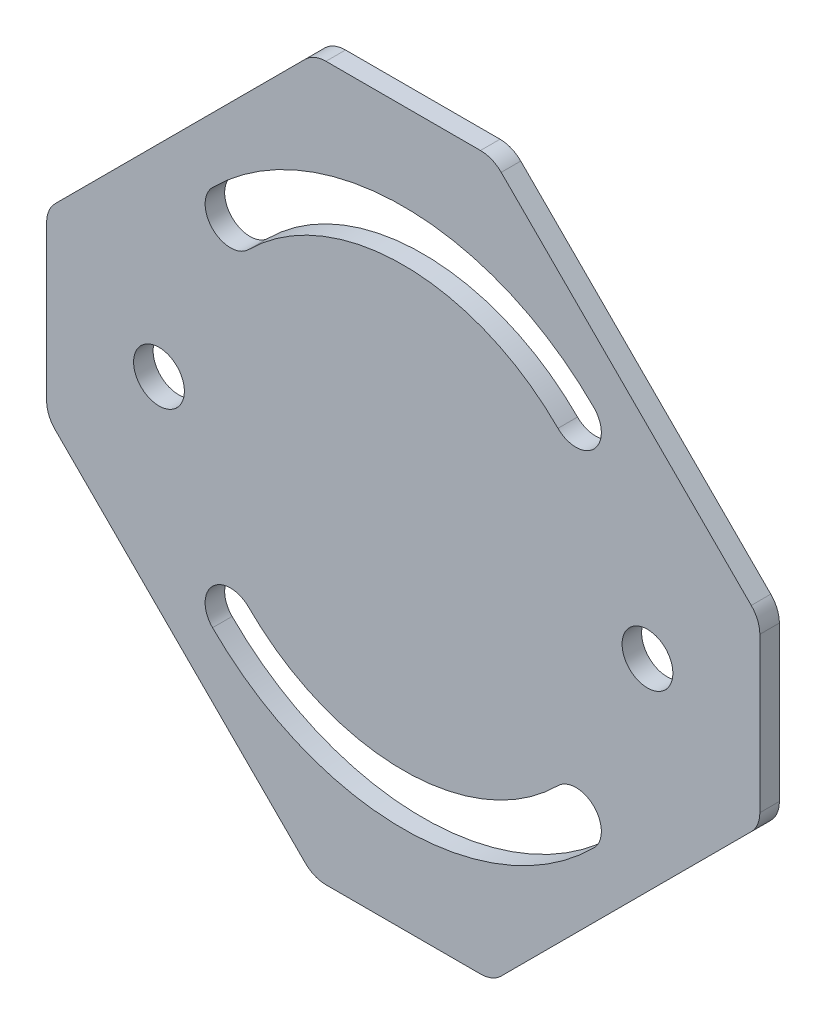
ISO-10303-21;
HEADER;
FILE_DESCRIPTION(('STEP AP214'),'2;1');
FILE_NAME('part.step','',(''),(''),'','','');
FILE_SCHEMA(('AUTOMOTIVE_DESIGN { 1 0 10303 214 1 1 1 1 }'));
ENDSEC;
DATA;
#1=APPLICATION_CONTEXT('core data for automotive mechanical design processes');
#2=APPLICATION_PROTOCOL_DEFINITION('international standard','automotive_design',2000,#1);
#3=PRODUCT_CONTEXT('',#1,'mechanical');
#4=PRODUCT('Part','Part','',(#3));
#5=PRODUCT_RELATED_PRODUCT_CATEGORY('part','',(#4));
#6=PRODUCT_DEFINITION_FORMATION('','',#4);
#7=PRODUCT_DEFINITION_CONTEXT('part definition',#1,'design');
#8=PRODUCT_DEFINITION('design','',#6,#7);
#9=PRODUCT_DEFINITION_SHAPE('','',#8);
#10=(LENGTH_UNIT() NAMED_UNIT(*) SI_UNIT(.MILLI.,.METRE.));
#11=(NAMED_UNIT(*) PLANE_ANGLE_UNIT() SI_UNIT($,.RADIAN.));
#12=(NAMED_UNIT(*) SI_UNIT($,.STERADIAN.) SOLID_ANGLE_UNIT());
#13=UNCERTAINTY_MEASURE_WITH_UNIT(LENGTH_MEASURE(1.E-05),#10,'distance_accuracy_value','');
#14=(GEOMETRIC_REPRESENTATION_CONTEXT(3) GLOBAL_UNCERTAINTY_ASSIGNED_CONTEXT((#13)) GLOBAL_UNIT_ASSIGNED_CONTEXT((#10,
#11,#12)) REPRESENTATION_CONTEXT('',''));
#15=CARTESIAN_POINT('',(0.,0.,0.));
#16=DIRECTION('',(0.,0.,1.));
#17=DIRECTION('',(1.,0.,0.));
#18=AXIS2_PLACEMENT_3D('',#15,#16,#17);
#19=CARTESIAN_POINT('',(0.,0.,2.));
#20=DIRECTION('',(0.,0.,-1.));
#21=DIRECTION('',(-1.,0.,0.));
#22=AXIS2_PLACEMENT_3D('',#19,#20,#21);
#23=PLANE('',#22);
#24=CARTESIAN_POINT('',(-17.6776695296638,-17.6776695296636,2.));
#25=DIRECTION('',(0.,0.,1.));
#26=DIRECTION('',(1.,0.,0.));
#27=AXIS2_PLACEMENT_3D('',#24,#25,#26);
#28=CIRCLE('',#27,2.6);
#29=CARTESIAN_POINT('',(-15.8391918985788,-15.8391918985786,2.));
#30=VERTEX_POINT('',#29);
#31=CARTESIAN_POINT('',(-19.5161471607488,-19.5161471607486,2.));
#32=VERTEX_POINT('',#31);
#33=EDGE_CURVE('E219',#30,#32,#28,.T.);
#34=ORIENTED_EDGE('',*,*,#33,.F.);
#35=CARTESIAN_POINT('',(0.,0.,2.));
#36=DIRECTION('',(0.,0.,-1.));
#37=DIRECTION('',(1.,0.,0.));
#38=AXIS2_PLACEMENT_3D('',#35,#36,#37);
#39=CIRCLE('',#38,22.4);
#40=CARTESIAN_POINT('',(15.8391918985788,-15.8391918985786,2.));
#41=VERTEX_POINT('',#40);
#42=EDGE_CURVE('E227',#41,#30,#39,.T.);
#43=ORIENTED_EDGE('',*,*,#42,.F.);
#44=CARTESIAN_POINT('',(17.6776695296638,-17.6776695296636,2.));
#45=DIRECTION('',(0.,0.,1.));
#46=DIRECTION('',(1.,0.,0.));
#47=AXIS2_PLACEMENT_3D('',#44,#45,#46);
#48=CIRCLE('',#47,2.6);
#49=CARTESIAN_POINT('',(19.5161471607488,-19.5161471607486,2.));
#50=VERTEX_POINT('',#49);
#51=EDGE_CURVE('E224',#50,#41,#48,.T.);
#52=ORIENTED_EDGE('',*,*,#51,.F.);
#53=CARTESIAN_POINT('',(0.,0.,2.));
#54=DIRECTION('',(0.,0.,1.));
#55=DIRECTION('',(1.,0.,0.));
#56=AXIS2_PLACEMENT_3D('',#53,#54,#55);
#57=CIRCLE('',#56,27.6);
#58=EDGE_CURVE('E221',#32,#50,#57,.T.);
#59=ORIENTED_EDGE('',*,*,#58,.F.);
#60=EDGE_LOOP('',(#34,#43,#52,#59));
#61=FACE_BOUND('',#60,.T.);
#62=DIRECTION('',(-0.707106781186548,0.707106781186548,0.));
#63=VECTOR('',#62,1.);
#64=CARTESIAN_POINT('',(9.15,36.5,2.));
#65=LINE('',#64,#63);
#66=CARTESIAN_POINT('',(35.6213203435597,10.0286796564403,2.));
#67=VERTEX_POINT('',#66);
#68=CARTESIAN_POINT('',(10.0286796564404,35.6213203435596,2.));
#69=VERTEX_POINT('',#68);
#70=EDGE_CURVE('E282',#67,#69,#65,.T.);
#71=ORIENTED_EDGE('',*,*,#70,.T.);
#72=CARTESIAN_POINT('',(7.90735931288072,33.5,2.));
#73=DIRECTION('',(0.,0.,-1.));
#74=DIRECTION('',(-1.,0.,0.));
#75=AXIS2_PLACEMENT_3D('',#72,#73,#74);
#76=CIRCLE('',#75,3.);
#77=CARTESIAN_POINT('',(7.90735931288072,36.5,2.));
#78=VERTEX_POINT('',#77);
#79=EDGE_CURVE('E345',#69,#78,#76,.F.);
#80=ORIENTED_EDGE('',*,*,#79,.T.);
#81=DIRECTION('',(-1.,0.,0.));
#82=VECTOR('',#81,1.);
#83=CARTESIAN_POINT('',(-9.15,36.5,2.));
#84=LINE('',#83,#82);
#85=CARTESIAN_POINT('',(-7.90735931288071,36.5,2.));
#86=VERTEX_POINT('',#85);
#87=EDGE_CURVE('E262',#78,#86,#84,.T.);
#88=ORIENTED_EDGE('',*,*,#87,.T.);
#89=CARTESIAN_POINT('',(-7.90735931288071,33.5,2.));
#90=DIRECTION('',(0.,0.,-1.));
#91=DIRECTION('',(-1.,0.,0.));
#92=AXIS2_PLACEMENT_3D('',#89,#90,#91);
#93=CIRCLE('',#92,3.);
#94=CARTESIAN_POINT('',(-10.0286796564404,35.6213203435596,2.));
#95=VERTEX_POINT('',#94);
#96=EDGE_CURVE('E332',#86,#95,#93,.F.);
#97=ORIENTED_EDGE('',*,*,#96,.T.);
#98=DIRECTION('',(-0.707106781186548,-0.707106781186547,0.));
#99=VECTOR('',#98,1.);
#100=CARTESIAN_POINT('',(-36.5,9.15,2.));
#101=LINE('',#100,#99);
#102=CARTESIAN_POINT('',(-35.6213203435596,10.0286796564404,2.));
#103=VERTEX_POINT('',#102);
#104=EDGE_CURVE('E265',#95,#103,#101,.T.);
#105=ORIENTED_EDGE('',*,*,#104,.T.);
#106=CARTESIAN_POINT('',(-33.5,7.90735931288071,2.));
#107=DIRECTION('',(0.,0.,-1.));
#108=DIRECTION('',(-1.,0.,0.));
#109=AXIS2_PLACEMENT_3D('',#106,#107,#108);
#110=CIRCLE('',#109,3.);
#111=CARTESIAN_POINT('',(-36.5,7.90735931288071,2.));
#112=VERTEX_POINT('',#111);
#113=EDGE_CURVE('E334',#103,#112,#110,.F.);
#114=ORIENTED_EDGE('',*,*,#113,.T.);
#115=DIRECTION('',(0.,-1.,0.));
#116=VECTOR('',#115,1.);
#117=CARTESIAN_POINT('',(-36.5,9.15,2.));
#118=LINE('',#117,#116);
#119=CARTESIAN_POINT('',(-36.5,-7.90735931288072,2.));
#120=VERTEX_POINT('',#119);
#121=EDGE_CURVE('E269',#112,#120,#118,.T.);
#122=ORIENTED_EDGE('',*,*,#121,.T.);
#123=CARTESIAN_POINT('',(-33.5,-7.90735931288072,2.));
#124=DIRECTION('',(0.,0.,-1.));
#125=DIRECTION('',(-1.,0.,0.));
#126=AXIS2_PLACEMENT_3D('',#123,#124,#125);
#127=CIRCLE('',#126,3.);
#128=CARTESIAN_POINT('',(-35.6213203435596,-10.0286796564404,2.));
#129=VERTEX_POINT('',#128);
#130=EDGE_CURVE('E336',#120,#129,#127,.F.);
#131=ORIENTED_EDGE('',*,*,#130,.T.);
#132=DIRECTION('',(0.707106781186548,-0.707106781186547,0.));
#133=VECTOR('',#132,1.);
#134=CARTESIAN_POINT('',(-36.5,-9.15,2.));
#135=LINE('',#134,#133);
#136=CARTESIAN_POINT('',(-10.0286796564404,-35.6213203435596,2.));
#137=VERTEX_POINT('',#136);
#138=EDGE_CURVE('E272',#129,#137,#135,.T.);
#139=ORIENTED_EDGE('',*,*,#138,.T.);
#140=CARTESIAN_POINT('',(-7.90735931288072,-33.5,2.));
#141=DIRECTION('',(0.,0.,-1.));
#142=DIRECTION('',(-1.,0.,0.));
#143=AXIS2_PLACEMENT_3D('',#140,#141,#142);
#144=CIRCLE('',#143,3.);
#145=CARTESIAN_POINT('',(-7.90735931288072,-36.5,2.));
#146=VERTEX_POINT('',#145);
#147=EDGE_CURVE('E338',#137,#146,#144,.F.);
#148=ORIENTED_EDGE('',*,*,#147,.T.);
#149=DIRECTION('',(1.,0.,0.));
#150=VECTOR('',#149,1.);
#151=CARTESIAN_POINT('',(-9.15,-36.5,2.));
#152=LINE('',#151,#150);
#153=CARTESIAN_POINT('',(7.90735931288072,-36.5,2.));
#154=VERTEX_POINT('',#153);
#155=EDGE_CURVE('E275',#146,#154,#152,.T.);
#156=ORIENTED_EDGE('',*,*,#155,.T.);
#157=CARTESIAN_POINT('',(7.90735931288072,-33.5,2.));
#158=DIRECTION('',(0.,0.,-1.));
#159=DIRECTION('',(-1.,0.,0.));
#160=AXIS2_PLACEMENT_3D('',#157,#158,#159);
#161=CIRCLE('',#160,3.);
#162=CARTESIAN_POINT('',(10.0286796564404,-35.6213203435596,2.));
#163=VERTEX_POINT('',#162);
#164=EDGE_CURVE('E340',#154,#163,#161,.F.);
#165=ORIENTED_EDGE('',*,*,#164,.T.);
#166=DIRECTION('',(0.707106781186547,0.707106781186547,0.));
#167=VECTOR('',#166,1.);
#168=CARTESIAN_POINT('',(9.15,-36.5,2.));
#169=LINE('',#168,#167);
#170=CARTESIAN_POINT('',(35.6213203435596,-10.0286796564404,2.));
#171=VERTEX_POINT('',#170);
#172=EDGE_CURVE('E278',#163,#171,#169,.T.);
#173=ORIENTED_EDGE('',*,*,#172,.T.);
#174=CARTESIAN_POINT('',(33.5,-7.90735931288072,2.));
#175=DIRECTION('',(0.,0.,-1.));
#176=DIRECTION('',(-1.,0.,0.));
#177=AXIS2_PLACEMENT_3D('',#174,#175,#176);
#178=CIRCLE('',#177,3.);
#179=CARTESIAN_POINT('',(36.5,-7.90735931288072,2.));
#180=VERTEX_POINT('',#179);
#181=EDGE_CURVE('E37',#171,#180,#178,.F.);
#182=ORIENTED_EDGE('',*,*,#181,.T.);
#183=DIRECTION('',(0.,1.,0.));
#184=VECTOR('',#183,1.);
#185=CARTESIAN_POINT('',(36.5,9.15,2.));
#186=LINE('',#185,#184);
#187=CARTESIAN_POINT('',(36.5,7.90735931288071,2.));
#188=VERTEX_POINT('',#187);
#189=EDGE_CURVE('E280',#180,#188,#186,.T.);
#190=ORIENTED_EDGE('',*,*,#189,.T.);
#191=CARTESIAN_POINT('',(33.5,7.90735931288071,2.));
#192=DIRECTION('',(0.,0.,-1.));
#193=DIRECTION('',(-1.,0.,0.));
#194=AXIS2_PLACEMENT_3D('',#191,#192,#193);
#195=CIRCLE('',#194,3.);
#196=EDGE_CURVE('E343',#188,#67,#195,.F.);
#197=ORIENTED_EDGE('',*,*,#196,.T.);
#198=EDGE_LOOP('',(#71,#80,#88,#97,#105,#114,#122,#131,#139,#148,#156,#165,#173,#182,#190,#197));
#199=FACE_BOUND('',#198,.T.);
#200=CARTESIAN_POINT('',(-25.,0.,2.));
#201=DIRECTION('',(0.,0.,1.));
#202=DIRECTION('',(1.,0.,0.));
#203=AXIS2_PLACEMENT_3D('',#200,#201,#202);
#204=CIRCLE('',#203,2.6);
#205=CARTESIAN_POINT('',(-22.4,0.,2.));
#206=VERTEX_POINT('',#205);
#207=EDGE_CURVE('E256',#206,#206,#204,.T.);
#208=ORIENTED_EDGE('',*,*,#207,.F.);
#209=EDGE_LOOP('',(#208));
#210=FACE_BOUND('',#209,.T.);
#211=CARTESIAN_POINT('',(25.,0.,2.));
#212=DIRECTION('',(0.,0.,1.));
#213=DIRECTION('',(1.,0.,0.));
#214=AXIS2_PLACEMENT_3D('',#211,#212,#213);
#215=CIRCLE('',#214,2.6);
#216=CARTESIAN_POINT('',(27.6,0.,2.));
#217=VERTEX_POINT('',#216);
#218=EDGE_CURVE('E250',#217,#217,#215,.T.);
#219=ORIENTED_EDGE('',*,*,#218,.F.);
#220=EDGE_LOOP('',(#219));
#221=FACE_BOUND('',#220,.T.);
#222=CARTESIAN_POINT('',(-17.6776695296638,17.6776695296636,2.));
#223=DIRECTION('',(0.,0.,1.));
#224=DIRECTION('',(-1.,0.,0.));
#225=AXIS2_PLACEMENT_3D('',#222,#223,#224);
#226=CIRCLE('',#225,2.6);
#227=CARTESIAN_POINT('',(-19.5161471607488,19.5161471607486,2.));
#228=VERTEX_POINT('',#227);
#229=CARTESIAN_POINT('',(-15.8391918985787,15.8391918985786,2.));
#230=VERTEX_POINT('',#229);
#231=EDGE_CURVE('E178',#228,#230,#226,.T.);
#232=ORIENTED_EDGE('',*,*,#231,.F.);
#233=CARTESIAN_POINT('',(0.,0.,2.));
#234=DIRECTION('',(0.,0.,1.));
#235=DIRECTION('',(-1.,0.,0.));
#236=AXIS2_PLACEMENT_3D('',#233,#234,#235);
#237=CIRCLE('',#236,27.6);
#238=CARTESIAN_POINT('',(19.5161471607488,19.5161471607486,2.));
#239=VERTEX_POINT('',#238);
#240=EDGE_CURVE('E203',#239,#228,#237,.T.);
#241=ORIENTED_EDGE('',*,*,#240,.F.);
#242=CARTESIAN_POINT('',(17.6776695296638,17.6776695296636,2.));
#243=DIRECTION('',(0.,0.,1.));
#244=DIRECTION('',(-1.,0.,0.));
#245=AXIS2_PLACEMENT_3D('',#242,#243,#244);
#246=CIRCLE('',#245,2.6);
#247=CARTESIAN_POINT('',(15.8391918985788,15.8391918985786,2.));
#248=VERTEX_POINT('',#247);
#249=EDGE_CURVE('E201',#248,#239,#246,.T.);
#250=ORIENTED_EDGE('',*,*,#249,.F.);
#251=CARTESIAN_POINT('',(0.,0.,2.));
#252=DIRECTION('',(0.,0.,-1.));
#253=DIRECTION('',(-1.,0.,0.));
#254=AXIS2_PLACEMENT_3D('',#251,#252,#253);
#255=CIRCLE('',#254,22.4);
#256=EDGE_CURVE('E188',#230,#248,#255,.T.);
#257=ORIENTED_EDGE('',*,*,#256,.F.);
#258=EDGE_LOOP('',(#232,#241,#250,#257));
#259=FACE_BOUND('',#258,.T.);
#260=ADVANCED_FACE('F15',(#61,#199,#210,#221,#259),#23,.F.);
#261=CARTESIAN_POINT('',(0.,0.,0.));
#262=DIRECTION('',(0.,0.,-1.));
#263=DIRECTION('',(-1.,0.,0.));
#264=AXIS2_PLACEMENT_3D('',#261,#262,#263);
#265=PLANE('',#264);
#266=CARTESIAN_POINT('',(-25.,0.,0.));
#267=DIRECTION('',(0.,0.,1.));
#268=DIRECTION('',(1.,0.,0.));
#269=AXIS2_PLACEMENT_3D('',#266,#267,#268);
#270=CIRCLE('',#269,2.6);
#271=CARTESIAN_POINT('',(-22.4,0.,0.));
#272=VERTEX_POINT('',#271);
#273=EDGE_CURVE('E253',#272,#272,#270,.T.);
#274=ORIENTED_EDGE('',*,*,#273,.T.);
#275=EDGE_LOOP('',(#274));
#276=FACE_BOUND('',#275,.T.);
#277=DIRECTION('',(-1.,0.,0.));
#278=VECTOR('',#277,1.);
#279=CARTESIAN_POINT('',(-9.15,36.5,0.));
#280=LINE('',#279,#278);
#281=CARTESIAN_POINT('',(7.90735931288072,36.5,0.));
#282=VERTEX_POINT('',#281);
#283=CARTESIAN_POINT('',(-7.90735931288071,36.5,0.));
#284=VERTEX_POINT('',#283);
#285=EDGE_CURVE('E259',#282,#284,#280,.T.);
#286=ORIENTED_EDGE('',*,*,#285,.F.);
#287=CARTESIAN_POINT('',(7.90735931288072,33.5,0.));
#288=DIRECTION('',(0.,0.,-1.));
#289=DIRECTION('',(-1.,0.,0.));
#290=AXIS2_PLACEMENT_3D('',#287,#288,#289);
#291=CIRCLE('',#290,3.);
#292=CARTESIAN_POINT('',(10.0286796564404,35.6213203435596,0.));
#293=VERTEX_POINT('',#292);
#294=EDGE_CURVE('E325',#282,#293,#291,.T.);
#295=ORIENTED_EDGE('',*,*,#294,.T.);
#296=DIRECTION('',(-0.707106781186548,0.707106781186548,0.));
#297=VECTOR('',#296,1.);
#298=CARTESIAN_POINT('',(9.15,36.5,0.));
#299=LINE('',#298,#297);
#300=CARTESIAN_POINT('',(35.6213203435597,10.0286796564403,0.));
#301=VERTEX_POINT('',#300);
#302=EDGE_CURVE('E266',#301,#293,#299,.T.);
#303=ORIENTED_EDGE('',*,*,#302,.F.);
#304=CARTESIAN_POINT('',(33.5,7.90735931288071,0.));
#305=DIRECTION('',(0.,0.,-1.));
#306=DIRECTION('',(-1.,0.,0.));
#307=AXIS2_PLACEMENT_3D('',#304,#305,#306);
#308=CIRCLE('',#307,3.);
#309=CARTESIAN_POINT('',(36.5,7.90735931288071,0.));
#310=VERTEX_POINT('',#309);
#311=EDGE_CURVE('E323',#301,#310,#308,.T.);
#312=ORIENTED_EDGE('',*,*,#311,.T.);
#313=DIRECTION('',(0.,1.,0.));
#314=VECTOR('',#313,1.);
#315=CARTESIAN_POINT('',(36.5,9.15,0.));
#316=LINE('',#315,#314);
#317=CARTESIAN_POINT('',(36.5,-7.90735931288072,0.));
#318=VERTEX_POINT('',#317);
#319=EDGE_CURVE('E303',#318,#310,#316,.T.);
#320=ORIENTED_EDGE('',*,*,#319,.F.);
#321=CARTESIAN_POINT('',(33.5,-7.90735931288072,0.));
#322=DIRECTION('',(0.,0.,-1.));
#323=DIRECTION('',(-1.,0.,0.));
#324=AXIS2_PLACEMENT_3D('',#321,#322,#323);
#325=CIRCLE('',#324,3.);
#326=CARTESIAN_POINT('',(35.6213203435596,-10.0286796564404,0.));
#327=VERTEX_POINT('',#326);
#328=EDGE_CURVE('E321',#318,#327,#325,.T.);
#329=ORIENTED_EDGE('',*,*,#328,.T.);
#330=DIRECTION('',(0.707106781186547,0.707106781186547,0.));
#331=VECTOR('',#330,1.);
#332=CARTESIAN_POINT('',(9.15,-36.5,0.));
#333=LINE('',#332,#331);
#334=CARTESIAN_POINT('',(10.0286796564404,-35.6213203435596,0.));
#335=VERTEX_POINT('',#334);
#336=EDGE_CURVE('E300',#335,#327,#333,.T.);
#337=ORIENTED_EDGE('',*,*,#336,.F.);
#338=CARTESIAN_POINT('',(7.90735931288072,-33.5,0.));
#339=DIRECTION('',(0.,0.,-1.));
#340=DIRECTION('',(-1.,0.,0.));
#341=AXIS2_PLACEMENT_3D('',#338,#339,#340);
#342=CIRCLE('',#341,3.);
#343=CARTESIAN_POINT('',(7.90735931288072,-36.5,0.));
#344=VERTEX_POINT('',#343);
#345=EDGE_CURVE('E319',#335,#344,#342,.T.);
#346=ORIENTED_EDGE('',*,*,#345,.T.);
#347=DIRECTION('',(1.,0.,0.));
#348=VECTOR('',#347,1.);
#349=CARTESIAN_POINT('',(-9.15,-36.5,0.));
#350=LINE('',#349,#348);
#351=CARTESIAN_POINT('',(-7.90735931288072,-36.5,0.));
#352=VERTEX_POINT('',#351);
#353=EDGE_CURVE('E297',#352,#344,#350,.T.);
#354=ORIENTED_EDGE('',*,*,#353,.F.);
#355=CARTESIAN_POINT('',(-7.90735931288072,-33.5,0.));
#356=DIRECTION('',(0.,0.,-1.));
#357=DIRECTION('',(-1.,0.,0.));
#358=AXIS2_PLACEMENT_3D('',#355,#356,#357);
#359=CIRCLE('',#358,3.);
#360=CARTESIAN_POINT('',(-10.0286796564404,-35.6213203435596,0.));
#361=VERTEX_POINT('',#360);
#362=EDGE_CURVE('E317',#352,#361,#359,.T.);
#363=ORIENTED_EDGE('',*,*,#362,.T.);
#364=DIRECTION('',(0.707106781186548,-0.707106781186547,0.));
#365=VECTOR('',#364,1.);
#366=CARTESIAN_POINT('',(-36.5,-9.15,0.));
#367=LINE('',#366,#365);
#368=CARTESIAN_POINT('',(-35.6213203435596,-10.0286796564404,0.));
#369=VERTEX_POINT('',#368);
#370=EDGE_CURVE('E294',#369,#361,#367,.T.);
#371=ORIENTED_EDGE('',*,*,#370,.F.);
#372=CARTESIAN_POINT('',(-33.5,-7.90735931288072,0.));
#373=DIRECTION('',(0.,0.,-1.));
#374=DIRECTION('',(-1.,0.,0.));
#375=AXIS2_PLACEMENT_3D('',#372,#373,#374);
#376=CIRCLE('',#375,3.);
#377=CARTESIAN_POINT('',(-36.5,-7.90735931288072,0.));
#378=VERTEX_POINT('',#377);
#379=EDGE_CURVE('E315',#369,#378,#376,.T.);
#380=ORIENTED_EDGE('',*,*,#379,.T.);
#381=DIRECTION('',(0.,-1.,0.));
#382=VECTOR('',#381,1.);
#383=CARTESIAN_POINT('',(-36.5,9.15,0.));
#384=LINE('',#383,#382);
#385=CARTESIAN_POINT('',(-36.5,7.90735931288071,0.));
#386=VERTEX_POINT('',#385);
#387=EDGE_CURVE('E291',#386,#378,#384,.T.);
#388=ORIENTED_EDGE('',*,*,#387,.F.);
#389=CARTESIAN_POINT('',(-33.5,7.90735931288071,0.));
#390=DIRECTION('',(0.,0.,-1.));
#391=DIRECTION('',(-1.,0.,0.));
#392=AXIS2_PLACEMENT_3D('',#389,#390,#391);
#393=CIRCLE('',#392,3.);
#394=CARTESIAN_POINT('',(-35.6213203435596,10.0286796564404,0.));
#395=VERTEX_POINT('',#394);
#396=EDGE_CURVE('E313',#386,#395,#393,.T.);
#397=ORIENTED_EDGE('',*,*,#396,.T.);
#398=DIRECTION('',(-0.707106781186548,-0.707106781186547,0.));
#399=VECTOR('',#398,1.);
#400=CARTESIAN_POINT('',(-36.5,9.15,0.));
#401=LINE('',#400,#399);
#402=CARTESIAN_POINT('',(-10.0286796564404,35.6213203435596,0.));
#403=VERTEX_POINT('',#402);
#404=EDGE_CURVE('E288',#403,#395,#401,.T.);
#405=ORIENTED_EDGE('',*,*,#404,.F.);
#406=CARTESIAN_POINT('',(-7.90735931288071,33.5,0.));
#407=DIRECTION('',(0.,0.,-1.));
#408=DIRECTION('',(-1.,0.,0.));
#409=AXIS2_PLACEMENT_3D('',#406,#407,#408);
#410=CIRCLE('',#409,3.);
#411=EDGE_CURVE('E311',#403,#284,#410,.T.);
#412=ORIENTED_EDGE('',*,*,#411,.T.);
#413=EDGE_LOOP('',(#286,#295,#303,#312,#320,#329,#337,#346,#354,#363,#371,#380,#388,#397,#405,#412));
#414=FACE_BOUND('',#413,.T.);
#415=CARTESIAN_POINT('',(25.,0.,0.));
#416=DIRECTION('',(0.,0.,1.));
#417=DIRECTION('',(1.,0.,0.));
#418=AXIS2_PLACEMENT_3D('',#415,#416,#417);
#419=CIRCLE('',#418,2.6);
#420=CARTESIAN_POINT('',(27.6,0.,0.));
#421=VERTEX_POINT('',#420);
#422=EDGE_CURVE('E249',#421,#421,#419,.T.);
#423=ORIENTED_EDGE('',*,*,#422,.T.);
#424=EDGE_LOOP('',(#423));
#425=FACE_BOUND('',#424,.T.);
#426=CARTESIAN_POINT('',(0.,0.,0.));
#427=DIRECTION('',(0.,0.,-1.));
#428=DIRECTION('',(1.,0.,0.));
#429=AXIS2_PLACEMENT_3D('',#426,#427,#428);
#430=CIRCLE('',#429,22.4);
#431=CARTESIAN_POINT('',(15.8391918985788,-15.8391918985786,0.));
#432=VERTEX_POINT('',#431);
#433=CARTESIAN_POINT('',(-15.8391918985788,-15.8391918985786,0.));
#434=VERTEX_POINT('',#433);
#435=EDGE_CURVE('E222',#432,#434,#430,.T.);
#436=ORIENTED_EDGE('',*,*,#435,.T.);
#437=CARTESIAN_POINT('',(-17.6776695296638,-17.6776695296636,0.));
#438=DIRECTION('',(0.,0.,1.));
#439=DIRECTION('',(1.,0.,0.));
#440=AXIS2_PLACEMENT_3D('',#437,#438,#439);
#441=CIRCLE('',#440,2.6);
#442=CARTESIAN_POINT('',(-19.5161471607488,-19.5161471607486,0.));
#443=VERTEX_POINT('',#442);
#444=EDGE_CURVE('E196',#434,#443,#441,.T.);
#445=ORIENTED_EDGE('',*,*,#444,.T.);
#446=CARTESIAN_POINT('',(0.,0.,0.));
#447=DIRECTION('',(0.,0.,1.));
#448=DIRECTION('',(1.,0.,0.));
#449=AXIS2_PLACEMENT_3D('',#446,#447,#448);
#450=CIRCLE('',#449,27.6);
#451=CARTESIAN_POINT('',(19.5161471607488,-19.5161471607486,0.));
#452=VERTEX_POINT('',#451);
#453=EDGE_CURVE('E232',#443,#452,#450,.T.);
#454=ORIENTED_EDGE('',*,*,#453,.T.);
#455=CARTESIAN_POINT('',(17.6776695296638,-17.6776695296636,0.));
#456=DIRECTION('',(0.,0.,1.));
#457=DIRECTION('',(1.,0.,0.));
#458=AXIS2_PLACEMENT_3D('',#455,#456,#457);
#459=CIRCLE('',#458,2.6);
#460=EDGE_CURVE('E235',#452,#432,#459,.T.);
#461=ORIENTED_EDGE('',*,*,#460,.T.);
#462=EDGE_LOOP('',(#436,#445,#454,#461));
#463=FACE_BOUND('',#462,.T.);
#464=CARTESIAN_POINT('',(0.,0.,0.));
#465=DIRECTION('',(0.,0.,1.));
#466=DIRECTION('',(-1.,0.,0.));
#467=AXIS2_PLACEMENT_3D('',#464,#465,#466);
#468=CIRCLE('',#467,27.6);
#469=CARTESIAN_POINT('',(19.5161471607488,19.5161471607486,0.));
#470=VERTEX_POINT('',#469);
#471=CARTESIAN_POINT('',(-19.5161471607488,19.5161471607486,0.));
#472=VERTEX_POINT('',#471);
#473=EDGE_CURVE('E189',#470,#472,#468,.T.);
#474=ORIENTED_EDGE('',*,*,#473,.T.);
#475=CARTESIAN_POINT('',(-17.6776695296638,17.6776695296636,0.));
#476=DIRECTION('',(0.,0.,1.));
#477=DIRECTION('',(-1.,0.,0.));
#478=AXIS2_PLACEMENT_3D('',#475,#476,#477);
#479=CIRCLE('',#478,2.6);
#480=CARTESIAN_POINT('',(-15.8391918985787,15.8391918985786,0.));
#481=VERTEX_POINT('',#480);
#482=EDGE_CURVE('E207',#472,#481,#479,.T.);
#483=ORIENTED_EDGE('',*,*,#482,.T.);
#484=CARTESIAN_POINT('',(0.,0.,0.));
#485=DIRECTION('',(0.,0.,-1.));
#486=DIRECTION('',(-1.,0.,0.));
#487=AXIS2_PLACEMENT_3D('',#484,#485,#486);
#488=CIRCLE('',#487,22.4);
#489=CARTESIAN_POINT('',(15.8391918985788,15.8391918985786,0.));
#490=VERTEX_POINT('',#489);
#491=EDGE_CURVE('E195',#481,#490,#488,.T.);
#492=ORIENTED_EDGE('',*,*,#491,.T.);
#493=CARTESIAN_POINT('',(17.6776695296638,17.6776695296636,0.));
#494=DIRECTION('',(0.,0.,1.));
#495=DIRECTION('',(-1.,0.,0.));
#496=AXIS2_PLACEMENT_3D('',#493,#494,#495);
#497=CIRCLE('',#496,2.6);
#498=EDGE_CURVE('E210',#490,#470,#497,.T.);
#499=ORIENTED_EDGE('',*,*,#498,.T.);
#500=EDGE_LOOP('',(#474,#483,#492,#499));
#501=FACE_BOUND('',#500,.T.);
#502=ADVANCED_FACE('F381',(#276,#414,#425,#463,#501),#265,.T.);
#503=CARTESIAN_POINT('',(-9.15,36.5,2.));
#504=DIRECTION('',(0.,-1.,0.));
#505=DIRECTION('',(0.,0.,-1.));
#506=AXIS2_PLACEMENT_3D('',#503,#504,#505);
#507=PLANE('',#506);
#508=ORIENTED_EDGE('',*,*,#87,.F.);
#509=DIRECTION('',(0.,0.,-1.));
#510=VECTOR('',#509,1.);
#511=CARTESIAN_POINT('',(7.90735931288072,36.5,2.));
#512=LINE('',#511,#510);
#513=EDGE_CURVE('E308',#78,#282,#512,.T.);
#514=ORIENTED_EDGE('',*,*,#513,.T.);
#515=ORIENTED_EDGE('',*,*,#285,.T.);
#516=DIRECTION('',(0.,0.,-1.));
#517=VECTOR('',#516,1.);
#518=CARTESIAN_POINT('',(-7.90735931288071,36.5,2.));
#519=LINE('',#518,#517);
#520=EDGE_CURVE('E285',#284,#86,#519,.F.);
#521=ORIENTED_EDGE('',*,*,#520,.T.);
#522=EDGE_LOOP('',(#508,#514,#515,#521));
#523=FACE_BOUND('',#522,.T.);
#524=ADVANCED_FACE('F440',(#523),#507,.F.);
#525=CARTESIAN_POINT('',(-36.5,9.15,2.));
#526=DIRECTION('',(0.707106781186547,-0.707106781186548,0.));
#527=DIRECTION('',(0.707106781186548,0.707106781186547,0.));
#528=AXIS2_PLACEMENT_3D('',#525,#526,#527);
#529=PLANE('',#528);
#530=ORIENTED_EDGE('',*,*,#404,.T.);
#531=DIRECTION('',(0.,0.,-1.));
#532=VECTOR('',#531,1.);
#533=CARTESIAN_POINT('',(-35.6213203435596,10.0286796564404,2.));
#534=LINE('',#533,#532);
#535=EDGE_CURVE('E9',#395,#103,#534,.F.);
#536=ORIENTED_EDGE('',*,*,#535,.T.);
#537=ORIENTED_EDGE('',*,*,#104,.F.);
#538=DIRECTION('',(0.,0.,-1.));
#539=VECTOR('',#538,1.);
#540=CARTESIAN_POINT('',(-10.0286796564404,35.6213203435596,2.));
#541=LINE('',#540,#539);
#542=EDGE_CURVE('E23',#95,#403,#541,.T.);
#543=ORIENTED_EDGE('',*,*,#542,.T.);
#544=EDGE_LOOP('',(#530,#536,#537,#543));
#545=FACE_BOUND('',#544,.T.);
#546=ADVANCED_FACE('F375',(#545),#529,.F.);
#547=CARTESIAN_POINT('',(-36.5,9.15,2.));
#548=DIRECTION('',(1.,0.,0.));
#549=DIRECTION('',(0.,1.,0.));
#550=AXIS2_PLACEMENT_3D('',#547,#548,#549);
#551=PLANE('',#550);
#552=ORIENTED_EDGE('',*,*,#387,.T.);
#553=DIRECTION('',(0.,0.,-1.));
#554=VECTOR('',#553,1.);
#555=CARTESIAN_POINT('',(-36.5,-7.90735931288072,2.));
#556=LINE('',#555,#554);
#557=EDGE_CURVE('E369',#378,#120,#556,.F.);
#558=ORIENTED_EDGE('',*,*,#557,.T.);
#559=ORIENTED_EDGE('',*,*,#121,.F.);
#560=DIRECTION('',(0.,0.,-1.));
#561=VECTOR('',#560,1.);
#562=CARTESIAN_POINT('',(-36.5,7.90735931288071,2.));
#563=LINE('',#562,#561);
#564=EDGE_CURVE('E366',#112,#386,#563,.T.);
#565=ORIENTED_EDGE('',*,*,#564,.T.);
#566=EDGE_LOOP('',(#552,#558,#559,#565));
#567=FACE_BOUND('',#566,.T.);
#568=ADVANCED_FACE('F390',(#567),#551,.F.);
#569=CARTESIAN_POINT('',(-36.5,-9.15,2.));
#570=DIRECTION('',(0.707106781186547,0.707106781186548,0.));
#571=DIRECTION('',(-0.707106781186548,0.707106781186547,0.));
#572=AXIS2_PLACEMENT_3D('',#569,#570,#571);
#573=PLANE('',#572);
#574=ORIENTED_EDGE('',*,*,#370,.T.);
#575=DIRECTION('',(0.,0.,-1.));
#576=VECTOR('',#575,1.);
#577=CARTESIAN_POINT('',(-10.0286796564404,-35.6213203435596,2.));
#578=LINE('',#577,#576);
#579=EDGE_CURVE('E364',#361,#137,#578,.F.);
#580=ORIENTED_EDGE('',*,*,#579,.T.);
#581=ORIENTED_EDGE('',*,*,#138,.F.);
#582=DIRECTION('',(0.,0.,-1.));
#583=VECTOR('',#582,1.);
#584=CARTESIAN_POINT('',(-35.6213203435596,-10.0286796564404,2.));
#585=LINE('',#584,#583);
#586=EDGE_CURVE('E361',#129,#369,#585,.T.);
#587=ORIENTED_EDGE('',*,*,#586,.T.);
#588=EDGE_LOOP('',(#574,#580,#581,#587));
#589=FACE_BOUND('',#588,.T.);
#590=ADVANCED_FACE('F400',(#589),#573,.F.);
#591=CARTESIAN_POINT('',(-9.15,-36.5,2.));
#592=DIRECTION('',(0.,1.,0.));
#593=DIRECTION('',(0.,0.,1.));
#594=AXIS2_PLACEMENT_3D('',#591,#592,#593);
#595=PLANE('',#594);
#596=ORIENTED_EDGE('',*,*,#353,.T.);
#597=DIRECTION('',(0.,0.,-1.));
#598=VECTOR('',#597,1.);
#599=CARTESIAN_POINT('',(7.90735931288072,-36.5,2.));
#600=LINE('',#599,#598);
#601=EDGE_CURVE('E359',#344,#154,#600,.F.);
#602=ORIENTED_EDGE('',*,*,#601,.T.);
#603=ORIENTED_EDGE('',*,*,#155,.F.);
#604=DIRECTION('',(0.,0.,-1.));
#605=VECTOR('',#604,1.);
#606=CARTESIAN_POINT('',(-7.90735931288072,-36.5,2.));
#607=LINE('',#606,#605);
#608=EDGE_CURVE('E356',#146,#352,#607,.T.);
#609=ORIENTED_EDGE('',*,*,#608,.T.);
#610=EDGE_LOOP('',(#596,#602,#603,#609));
#611=FACE_BOUND('',#610,.T.);
#612=ADVANCED_FACE('F409',(#611),#595,.F.);
#613=CARTESIAN_POINT('',(9.15,-36.5,2.));
#614=DIRECTION('',(-0.707106781186547,0.707106781186547,0.));
#615=DIRECTION('',(-0.707106781186548,-0.707106781186548,0.));
#616=AXIS2_PLACEMENT_3D('',#613,#614,#615);
#617=PLANE('',#616);
#618=ORIENTED_EDGE('',*,*,#336,.T.);
#619=DIRECTION('',(0.,0.,-1.));
#620=VECTOR('',#619,1.);
#621=CARTESIAN_POINT('',(35.6213203435596,-10.0286796564404,2.));
#622=LINE('',#621,#620);
#623=EDGE_CURVE('E354',#327,#171,#622,.F.);
#624=ORIENTED_EDGE('',*,*,#623,.T.);
#625=ORIENTED_EDGE('',*,*,#172,.F.);
#626=DIRECTION('',(0.,0.,-1.));
#627=VECTOR('',#626,1.);
#628=CARTESIAN_POINT('',(10.0286796564404,-35.6213203435596,2.));
#629=LINE('',#628,#627);
#630=EDGE_CURVE('E351',#163,#335,#629,.T.);
#631=ORIENTED_EDGE('',*,*,#630,.T.);
#632=EDGE_LOOP('',(#618,#624,#625,#631));
#633=FACE_BOUND('',#632,.T.);
#634=ADVANCED_FACE('F418',(#633),#617,.F.);
#635=CARTESIAN_POINT('',(36.5,9.15,2.));
#636=DIRECTION('',(-1.,0.,0.));
#637=DIRECTION('',(0.,-1.,0.));
#638=AXIS2_PLACEMENT_3D('',#635,#636,#637);
#639=PLANE('',#638);
#640=ORIENTED_EDGE('',*,*,#319,.T.);
#641=DIRECTION('',(0.,0.,-1.));
#642=VECTOR('',#641,1.);
#643=CARTESIAN_POINT('',(36.5,7.90735931288071,2.));
#644=LINE('',#643,#642);
#645=EDGE_CURVE('E30',#310,#188,#644,.F.);
#646=ORIENTED_EDGE('',*,*,#645,.T.);
#647=ORIENTED_EDGE('',*,*,#189,.F.);
#648=DIRECTION('',(0.,0.,-1.));
#649=VECTOR('',#648,1.);
#650=CARTESIAN_POINT('',(36.5,-7.90735931288072,2.));
#651=LINE('',#650,#649);
#652=EDGE_CURVE('E347',#180,#318,#651,.T.);
#653=ORIENTED_EDGE('',*,*,#652,.T.);
#654=EDGE_LOOP('',(#640,#646,#647,#653));
#655=FACE_BOUND('',#654,.T.);
#656=ADVANCED_FACE('F424',(#655),#639,.F.);
#657=CARTESIAN_POINT('',(9.15,36.5,2.));
#658=DIRECTION('',(-0.707106781186547,-0.707106781186547,0.));
#659=DIRECTION('',(0.707106781186548,-0.707106781186548,0.));
#660=AXIS2_PLACEMENT_3D('',#657,#658,#659);
#661=PLANE('',#660);
#662=ORIENTED_EDGE('',*,*,#302,.T.);
#663=DIRECTION('',(0.,0.,-1.));
#664=VECTOR('',#663,1.);
#665=CARTESIAN_POINT('',(10.0286796564404,35.6213203435596,2.));
#666=LINE('',#665,#664);
#667=EDGE_CURVE('E330',#293,#69,#666,.F.);
#668=ORIENTED_EDGE('',*,*,#667,.T.);
#669=ORIENTED_EDGE('',*,*,#70,.F.);
#670=DIRECTION('',(0.,0.,-1.));
#671=VECTOR('',#670,1.);
#672=CARTESIAN_POINT('',(35.6213203435596,10.0286796564404,2.));
#673=LINE('',#672,#671);
#674=EDGE_CURVE('E327',#67,#301,#673,.T.);
#675=ORIENTED_EDGE('',*,*,#674,.T.);
#676=EDGE_LOOP('',(#662,#668,#669,#675));
#677=FACE_BOUND('',#676,.T.);
#678=ADVANCED_FACE('F432',(#677),#661,.F.);
#679=CARTESIAN_POINT('',(-25.,0.,2.));
#680=DIRECTION('',(0.,0.,-1.));
#681=DIRECTION('',(-1.,0.,0.));
#682=AXIS2_PLACEMENT_3D('',#679,#680,#681);
#683=CYLINDRICAL_SURFACE('',#682,2.6);
#684=ORIENTED_EDGE('',*,*,#207,.T.);
#685=EDGE_LOOP('',(#684));
#686=FACE_BOUND('',#685,.T.);
#687=ORIENTED_EDGE('',*,*,#273,.F.);
#688=EDGE_LOOP('',(#687));
#689=FACE_BOUND('',#688,.T.);
#690=ADVANCED_FACE('F457',(#686,#689),#683,.F.);
#691=CARTESIAN_POINT('',(25.,0.,2.));
#692=DIRECTION('',(0.,0.,-1.));
#693=DIRECTION('',(-1.,0.,0.));
#694=AXIS2_PLACEMENT_3D('',#691,#692,#693);
#695=CYLINDRICAL_SURFACE('',#694,2.6);
#696=ORIENTED_EDGE('',*,*,#218,.T.);
#697=EDGE_LOOP('',(#696));
#698=FACE_BOUND('',#697,.T.);
#699=ORIENTED_EDGE('',*,*,#422,.F.);
#700=EDGE_LOOP('',(#699));
#701=FACE_BOUND('',#700,.T.);
#702=ADVANCED_FACE('F651',(#698,#701),#695,.F.);
#703=CARTESIAN_POINT('',(-17.6776695296638,-17.6776695296636,2.));
#704=DIRECTION('',(0.,0.,-1.));
#705=DIRECTION('',(-1.,0.,0.));
#706=AXIS2_PLACEMENT_3D('',#703,#704,#705);
#707=CYLINDRICAL_SURFACE('',#706,2.6);
#708=ORIENTED_EDGE('',*,*,#444,.F.);
#709=DIRECTION('',(0.,0.,-1.));
#710=VECTOR('',#709,1.);
#711=CARTESIAN_POINT('',(-15.8391918985788,-15.8391918985786,2.));
#712=LINE('',#711,#710);
#713=EDGE_CURVE('E229',#30,#434,#712,.T.);
#714=ORIENTED_EDGE('',*,*,#713,.F.);
#715=ORIENTED_EDGE('',*,*,#33,.T.);
#716=DIRECTION('',(0.,0.,-1.));
#717=VECTOR('',#716,1.);
#718=CARTESIAN_POINT('',(-19.5161471607488,-19.5161471607486,2.));
#719=LINE('',#718,#717);
#720=EDGE_CURVE('E246',#32,#443,#719,.T.);
#721=ORIENTED_EDGE('',*,*,#720,.T.);
#722=EDGE_LOOP('',(#708,#714,#715,#721));
#723=FACE_BOUND('',#722,.T.);
#724=ADVANCED_FACE('F642',(#723),#707,.F.);
#725=CARTESIAN_POINT('',(0.,0.,2.));
#726=DIRECTION('',(0.,0.,-1.));
#727=DIRECTION('',(-1.,0.,0.));
#728=AXIS2_PLACEMENT_3D('',#725,#726,#727);
#729=CYLINDRICAL_SURFACE('',#728,27.6);
#730=ORIENTED_EDGE('',*,*,#453,.F.);
#731=ORIENTED_EDGE('',*,*,#720,.F.);
#732=ORIENTED_EDGE('',*,*,#58,.T.);
#733=DIRECTION('',(0.,0.,-1.));
#734=VECTOR('',#733,1.);
#735=CARTESIAN_POINT('',(19.5161471607488,-19.5161471607486,2.));
#736=LINE('',#735,#734);
#737=EDGE_CURVE('E244',#50,#452,#736,.T.);
#738=ORIENTED_EDGE('',*,*,#737,.T.);
#739=EDGE_LOOP('',(#730,#731,#732,#738));
#740=FACE_BOUND('',#739,.T.);
#741=ADVANCED_FACE('F633',(#740),#729,.F.);
#742=CARTESIAN_POINT('',(17.6776695296638,-17.6776695296636,2.));
#743=DIRECTION('',(0.,0.,-1.));
#744=DIRECTION('',(-1.,0.,0.));
#745=AXIS2_PLACEMENT_3D('',#742,#743,#744);
#746=CYLINDRICAL_SURFACE('',#745,2.6);
#747=ORIENTED_EDGE('',*,*,#460,.F.);
#748=ORIENTED_EDGE('',*,*,#737,.F.);
#749=ORIENTED_EDGE('',*,*,#51,.T.);
#750=DIRECTION('',(0.,0.,-1.));
#751=VECTOR('',#750,1.);
#752=CARTESIAN_POINT('',(15.8391918985788,-15.8391918985786,2.));
#753=LINE('',#752,#751);
#754=EDGE_CURVE('E242',#41,#432,#753,.T.);
#755=ORIENTED_EDGE('',*,*,#754,.T.);
#756=EDGE_LOOP('',(#747,#748,#749,#755));
#757=FACE_BOUND('',#756,.T.);
#758=ADVANCED_FACE('F624',(#757),#746,.F.);
#759=CARTESIAN_POINT('',(0.,0.,2.));
#760=DIRECTION('',(0.,0.,-1.));
#761=DIRECTION('',(-1.,0.,0.));
#762=AXIS2_PLACEMENT_3D('',#759,#760,#761);
#763=CYLINDRICAL_SURFACE('',#762,22.4);
#764=ORIENTED_EDGE('',*,*,#435,.F.);
#765=ORIENTED_EDGE('',*,*,#754,.F.);
#766=ORIENTED_EDGE('',*,*,#42,.T.);
#767=ORIENTED_EDGE('',*,*,#713,.T.);
#768=EDGE_LOOP('',(#764,#765,#766,#767));
#769=FACE_BOUND('',#768,.T.);
#770=ADVANCED_FACE('F616',(#769),#763,.T.);
#771=CARTESIAN_POINT('',(-17.6776695296638,17.6776695296636,2.));
#772=DIRECTION('',(0.,0.,-1.));
#773=DIRECTION('',(-1.,0.,0.));
#774=AXIS2_PLACEMENT_3D('',#771,#772,#773);
#775=CYLINDRICAL_SURFACE('',#774,2.6);
#776=ORIENTED_EDGE('',*,*,#482,.F.);
#777=DIRECTION('',(0.,0.,-1.));
#778=VECTOR('',#777,1.);
#779=CARTESIAN_POINT('',(-19.5161471607488,19.5161471607486,2.));
#780=LINE('',#779,#778);
#781=EDGE_CURVE('E184',#228,#472,#780,.T.);
#782=ORIENTED_EDGE('',*,*,#781,.F.);
#783=ORIENTED_EDGE('',*,*,#231,.T.);
#784=DIRECTION('',(0.,0.,-1.));
#785=VECTOR('',#784,1.);
#786=CARTESIAN_POINT('',(-15.8391918985787,15.8391918985786,2.));
#787=LINE('',#786,#785);
#788=EDGE_CURVE('E181',#230,#481,#787,.T.);
#789=ORIENTED_EDGE('',*,*,#788,.T.);
#790=EDGE_LOOP('',(#776,#782,#783,#789));
#791=FACE_BOUND('',#790,.T.);
#792=ADVANCED_FACE('F180',(#791),#775,.F.);
#793=CARTESIAN_POINT('',(0.,0.,2.));
#794=DIRECTION('',(0.,0.,-1.));
#795=DIRECTION('',(-1.,0.,0.));
#796=AXIS2_PLACEMENT_3D('',#793,#794,#795);
#797=CYLINDRICAL_SURFACE('',#796,22.4);
#798=ORIENTED_EDGE('',*,*,#491,.F.);
#799=ORIENTED_EDGE('',*,*,#788,.F.);
#800=ORIENTED_EDGE('',*,*,#256,.T.);
#801=DIRECTION('',(0.,0.,-1.));
#802=VECTOR('',#801,1.);
#803=CARTESIAN_POINT('',(15.8391918985788,15.8391918985786,2.));
#804=LINE('',#803,#802);
#805=EDGE_CURVE('E197',#248,#490,#804,.T.);
#806=ORIENTED_EDGE('',*,*,#805,.T.);
#807=EDGE_LOOP('',(#798,#799,#800,#806));
#808=FACE_BOUND('',#807,.T.);
#809=ADVANCED_FACE('F192',(#808),#797,.T.);
#810=CARTESIAN_POINT('',(17.6776695296638,17.6776695296636,2.));
#811=DIRECTION('',(0.,0.,-1.));
#812=DIRECTION('',(-1.,0.,0.));
#813=AXIS2_PLACEMENT_3D('',#810,#811,#812);
#814=CYLINDRICAL_SURFACE('',#813,2.6);
#815=ORIENTED_EDGE('',*,*,#498,.F.);
#816=ORIENTED_EDGE('',*,*,#805,.F.);
#817=ORIENTED_EDGE('',*,*,#249,.T.);
#818=DIRECTION('',(0.,0.,-1.));
#819=VECTOR('',#818,1.);
#820=CARTESIAN_POINT('',(19.5161471607488,19.5161471607486,2.));
#821=LINE('',#820,#819);
#822=EDGE_CURVE('E216',#239,#470,#821,.T.);
#823=ORIENTED_EDGE('',*,*,#822,.T.);
#824=EDGE_LOOP('',(#815,#816,#817,#823));
#825=FACE_BOUND('',#824,.T.);
#826=ADVANCED_FACE('F592',(#825),#814,.F.);
#827=CARTESIAN_POINT('',(0.,0.,2.));
#828=DIRECTION('',(0.,0.,-1.));
#829=DIRECTION('',(-1.,0.,0.));
#830=AXIS2_PLACEMENT_3D('',#827,#828,#829);
#831=CYLINDRICAL_SURFACE('',#830,27.6);
#832=ORIENTED_EDGE('',*,*,#473,.F.);
#833=ORIENTED_EDGE('',*,*,#822,.F.);
#834=ORIENTED_EDGE('',*,*,#240,.T.);
#835=ORIENTED_EDGE('',*,*,#781,.T.);
#836=EDGE_LOOP('',(#832,#833,#834,#835));
#837=FACE_BOUND('',#836,.T.);
#838=ADVANCED_FACE('F478',(#837),#831,.F.);
#839=CARTESIAN_POINT('',(7.90735931288072,33.5,2.));
#840=DIRECTION('',(0.,0.,-1.));
#841=DIRECTION('',(-1.,0.,0.));
#842=AXIS2_PLACEMENT_3D('',#839,#840,#841);
#843=CYLINDRICAL_SURFACE('',#842,3.);
#844=ORIENTED_EDGE('',*,*,#79,.F.);
#845=ORIENTED_EDGE('',*,*,#667,.F.);
#846=ORIENTED_EDGE('',*,*,#294,.F.);
#847=ORIENTED_EDGE('',*,*,#513,.F.);
#848=EDGE_LOOP('',(#844,#845,#846,#847));
#849=FACE_BOUND('',#848,.T.);
#850=ADVANCED_FACE('F437',(#849),#843,.T.);
#851=CARTESIAN_POINT('',(33.5,7.90735931288071,2.));
#852=DIRECTION('',(0.,0.,-1.));
#853=DIRECTION('',(-1.,0.,0.));
#854=AXIS2_PLACEMENT_3D('',#851,#852,#853);
#855=CYLINDRICAL_SURFACE('',#854,3.);
#856=ORIENTED_EDGE('',*,*,#196,.F.);
#857=ORIENTED_EDGE('',*,*,#645,.F.);
#858=ORIENTED_EDGE('',*,*,#311,.F.);
#859=ORIENTED_EDGE('',*,*,#674,.F.);
#860=EDGE_LOOP('',(#856,#857,#858,#859));
#861=FACE_BOUND('',#860,.T.);
#862=ADVANCED_FACE('F429',(#861),#855,.T.);
#863=CARTESIAN_POINT('',(33.5,-7.90735931288072,2.));
#864=DIRECTION('',(0.,0.,-1.));
#865=DIRECTION('',(-1.,0.,0.));
#866=AXIS2_PLACEMENT_3D('',#863,#864,#865);
#867=CYLINDRICAL_SURFACE('',#866,3.);
#868=ORIENTED_EDGE('',*,*,#181,.F.);
#869=ORIENTED_EDGE('',*,*,#623,.F.);
#870=ORIENTED_EDGE('',*,*,#328,.F.);
#871=ORIENTED_EDGE('',*,*,#652,.F.);
#872=EDGE_LOOP('',(#868,#869,#870,#871));
#873=FACE_BOUND('',#872,.T.);
#874=ADVANCED_FACE('F423',(#873),#867,.T.);
#875=CARTESIAN_POINT('',(7.90735931288072,-33.5,2.));
#876=DIRECTION('',(0.,0.,-1.));
#877=DIRECTION('',(-1.,0.,0.));
#878=AXIS2_PLACEMENT_3D('',#875,#876,#877);
#879=CYLINDRICAL_SURFACE('',#878,3.);
#880=ORIENTED_EDGE('',*,*,#164,.F.);
#881=ORIENTED_EDGE('',*,*,#601,.F.);
#882=ORIENTED_EDGE('',*,*,#345,.F.);
#883=ORIENTED_EDGE('',*,*,#630,.F.);
#884=EDGE_LOOP('',(#880,#881,#882,#883));
#885=FACE_BOUND('',#884,.T.);
#886=ADVANCED_FACE('F415',(#885),#879,.T.);
#887=CARTESIAN_POINT('',(-7.90735931288072,-33.5,2.));
#888=DIRECTION('',(0.,0.,-1.));
#889=DIRECTION('',(-1.,0.,0.));
#890=AXIS2_PLACEMENT_3D('',#887,#888,#889);
#891=CYLINDRICAL_SURFACE('',#890,3.);
#892=ORIENTED_EDGE('',*,*,#147,.F.);
#893=ORIENTED_EDGE('',*,*,#579,.F.);
#894=ORIENTED_EDGE('',*,*,#362,.F.);
#895=ORIENTED_EDGE('',*,*,#608,.F.);
#896=EDGE_LOOP('',(#892,#893,#894,#895));
#897=FACE_BOUND('',#896,.T.);
#898=ADVANCED_FACE('F406',(#897),#891,.T.);
#899=CARTESIAN_POINT('',(-33.5,-7.90735931288072,2.));
#900=DIRECTION('',(0.,0.,-1.));
#901=DIRECTION('',(-1.,0.,0.));
#902=AXIS2_PLACEMENT_3D('',#899,#900,#901);
#903=CYLINDRICAL_SURFACE('',#902,3.);
#904=ORIENTED_EDGE('',*,*,#130,.F.);
#905=ORIENTED_EDGE('',*,*,#557,.F.);
#906=ORIENTED_EDGE('',*,*,#379,.F.);
#907=ORIENTED_EDGE('',*,*,#586,.F.);
#908=EDGE_LOOP('',(#904,#905,#906,#907));
#909=FACE_BOUND('',#908,.T.);
#910=ADVANCED_FACE('F397',(#909),#903,.T.);
#911=CARTESIAN_POINT('',(-33.5,7.90735931288071,2.));
#912=DIRECTION('',(0.,0.,-1.));
#913=DIRECTION('',(-1.,0.,0.));
#914=AXIS2_PLACEMENT_3D('',#911,#912,#913);
#915=CYLINDRICAL_SURFACE('',#914,3.);
#916=ORIENTED_EDGE('',*,*,#113,.F.);
#917=ORIENTED_EDGE('',*,*,#535,.F.);
#918=ORIENTED_EDGE('',*,*,#396,.F.);
#919=ORIENTED_EDGE('',*,*,#564,.F.);
#920=EDGE_LOOP('',(#916,#917,#918,#919));
#921=FACE_BOUND('',#920,.T.);
#922=ADVANCED_FACE('F387',(#921),#915,.T.);
#923=CARTESIAN_POINT('',(-7.90735931288071,33.5,2.));
#924=DIRECTION('',(0.,0.,-1.));
#925=DIRECTION('',(-1.,0.,0.));
#926=AXIS2_PLACEMENT_3D('',#923,#924,#925);
#927=CYLINDRICAL_SURFACE('',#926,3.);
#928=ORIENTED_EDGE('',*,*,#96,.F.);
#929=ORIENTED_EDGE('',*,*,#520,.F.);
#930=ORIENTED_EDGE('',*,*,#411,.F.);
#931=ORIENTED_EDGE('',*,*,#542,.F.);
#932=EDGE_LOOP('',(#928,#929,#930,#931));
#933=FACE_BOUND('',#932,.T.);
#934=ADVANCED_FACE('F17',(#933),#927,.T.);
#935=CLOSED_SHELL('',(#260,#502,#524,#546,#568,#590,#612,#634,#656,#678,#690,#702,#724,#741,
#758,#770,#792,#809,#826,#838,#850,#862,#874,#886,#898,#910,#922,#934));
#936=MANIFOLD_SOLID_BREP('B1',#935);
#937=ADVANCED_BREP_SHAPE_REPRESENTATION('',(#18,#936),#14);
#938=SHAPE_DEFINITION_REPRESENTATION(#9,#937);
ENDSEC;
END-ISO-10303-21;
